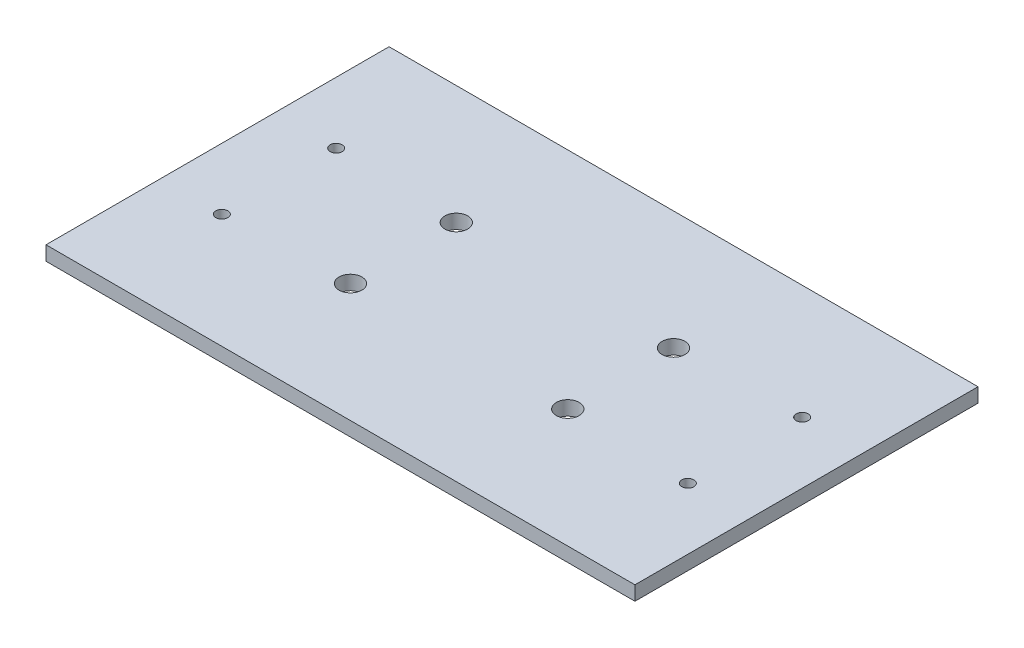
ISO-10303-21;
HEADER;
FILE_DESCRIPTION(('STEP AP214'),'2;1');
FILE_NAME('part.step','',(''),(''),'','','');
FILE_SCHEMA(('AUTOMOTIVE_DESIGN { 1 0 10303 214 1 1 1 1 }'));
ENDSEC;
DATA;
#1=APPLICATION_CONTEXT('core data for automotive mechanical design processes');
#2=APPLICATION_PROTOCOL_DEFINITION('international standard','automotive_design',2000,#1);
#3=PRODUCT_CONTEXT('',#1,'mechanical');
#4=PRODUCT('Part','Part','',(#3));
#5=PRODUCT_RELATED_PRODUCT_CATEGORY('part','',(#4));
#6=PRODUCT_DEFINITION_FORMATION('','',#4);
#7=PRODUCT_DEFINITION_CONTEXT('part definition',#1,'design');
#8=PRODUCT_DEFINITION('design','',#6,#7);
#9=PRODUCT_DEFINITION_SHAPE('','',#8);
#10=(LENGTH_UNIT() NAMED_UNIT(*) SI_UNIT(.MILLI.,.METRE.));
#11=(NAMED_UNIT(*) PLANE_ANGLE_UNIT() SI_UNIT($,.RADIAN.));
#12=(NAMED_UNIT(*) SI_UNIT($,.STERADIAN.) SOLID_ANGLE_UNIT());
#13=UNCERTAINTY_MEASURE_WITH_UNIT(LENGTH_MEASURE(1.E-05),#10,'distance_accuracy_value','');
#14=(GEOMETRIC_REPRESENTATION_CONTEXT(3) GLOBAL_UNCERTAINTY_ASSIGNED_CONTEXT((#13)) GLOBAL_UNIT_ASSIGNED_CONTEXT((#10,
#11,#12)) REPRESENTATION_CONTEXT('',''));
#15=CARTESIAN_POINT('',(0.,0.,0.));
#16=DIRECTION('',(0.,0.,1.));
#17=DIRECTION('',(1.,0.,0.));
#18=AXIS2_PLACEMENT_3D('',#15,#16,#17);
#19=CARTESIAN_POINT('',(103.,5.,60.));
#20=DIRECTION('',(-1.,0.,0.));
#21=DIRECTION('',(0.,0.,1.));
#22=AXIS2_PLACEMENT_3D('',#19,#20,#21);
#23=PLANE('',#22);
#24=DIRECTION('',(0.,0.,-1.));
#25=VECTOR('',#24,1.);
#26=CARTESIAN_POINT('',(103.,0.,60.));
#27=LINE('',#26,#25);
#28=CARTESIAN_POINT('',(103.,0.,60.));
#29=VERTEX_POINT('',#28);
#30=CARTESIAN_POINT('',(103.,0.,-60.));
#31=VERTEX_POINT('',#30);
#32=EDGE_CURVE('E100',#29,#31,#27,.T.);
#33=ORIENTED_EDGE('',*,*,#32,.T.);
#34=DIRECTION('',(0.,-1.,0.));
#35=VECTOR('',#34,1.);
#36=CARTESIAN_POINT('',(103.,5.,-60.));
#37=LINE('',#36,#35);
#38=CARTESIAN_POINT('',(103.,5.,-60.));
#39=VERTEX_POINT('',#38);
#40=EDGE_CURVE('E11',#39,#31,#37,.T.);
#41=ORIENTED_EDGE('',*,*,#40,.F.);
#42=DIRECTION('',(0.,0.,-1.));
#43=VECTOR('',#42,1.);
#44=CARTESIAN_POINT('',(103.,5.,60.));
#45=LINE('',#44,#43);
#46=CARTESIAN_POINT('',(103.,5.,60.));
#47=VERTEX_POINT('',#46);
#48=EDGE_CURVE('E88',#47,#39,#45,.T.);
#49=ORIENTED_EDGE('',*,*,#48,.F.);
#50=DIRECTION('',(0.,-1.,0.));
#51=VECTOR('',#50,1.);
#52=CARTESIAN_POINT('',(103.,5.,60.));
#53=LINE('',#52,#51);
#54=EDGE_CURVE('E96',#47,#29,#53,.T.);
#55=ORIENTED_EDGE('',*,*,#54,.T.);
#56=EDGE_LOOP('',(#33,#41,#49,#55));
#57=FACE_BOUND('',#56,.T.);
#58=ADVANCED_FACE('F37',(#57),#23,.F.);
#59=CARTESIAN_POINT('',(-103.,5.,-60.));
#60=DIRECTION('',(0.,0.,1.));
#61=DIRECTION('',(1.,0.,0.));
#62=AXIS2_PLACEMENT_3D('',#59,#60,#61);
#63=PLANE('',#62);
#64=DIRECTION('',(-1.,0.,0.));
#65=VECTOR('',#64,1.);
#66=CARTESIAN_POINT('',(-103.,0.,-60.));
#67=LINE('',#66,#65);
#68=CARTESIAN_POINT('',(-103.,0.,-60.));
#69=VERTEX_POINT('',#68);
#70=EDGE_CURVE('E92',#31,#69,#67,.T.);
#71=ORIENTED_EDGE('',*,*,#70,.T.);
#72=DIRECTION('',(0.,-1.,0.));
#73=VECTOR('',#72,1.);
#74=CARTESIAN_POINT('',(-103.,5.,-60.));
#75=LINE('',#74,#73);
#76=CARTESIAN_POINT('',(-103.,5.,-60.));
#77=VERTEX_POINT('',#76);
#78=EDGE_CURVE('E45',#77,#69,#75,.T.);
#79=ORIENTED_EDGE('',*,*,#78,.F.);
#80=DIRECTION('',(-1.,0.,0.));
#81=VECTOR('',#80,1.);
#82=CARTESIAN_POINT('',(-103.,5.,-60.));
#83=LINE('',#82,#81);
#84=EDGE_CURVE('E83',#39,#77,#83,.T.);
#85=ORIENTED_EDGE('',*,*,#84,.F.);
#86=ORIENTED_EDGE('',*,*,#40,.T.);
#87=EDGE_LOOP('',(#71,#79,#85,#86));
#88=FACE_BOUND('',#87,.T.);
#89=ADVANCED_FACE('F91',(#88),#63,.F.);
#90=CARTESIAN_POINT('',(-103.,5.,60.));
#91=DIRECTION('',(1.,0.,0.));
#92=DIRECTION('',(0.,0.,-1.));
#93=AXIS2_PLACEMENT_3D('',#90,#91,#92);
#94=PLANE('',#93);
#95=DIRECTION('',(0.,0.,1.));
#96=VECTOR('',#95,1.);
#97=CARTESIAN_POINT('',(-103.,0.,60.));
#98=LINE('',#97,#96);
#99=CARTESIAN_POINT('',(-103.,0.,60.));
#100=VERTEX_POINT('',#99);
#101=EDGE_CURVE('E70',#69,#100,#98,.T.);
#102=ORIENTED_EDGE('',*,*,#101,.T.);
#103=DIRECTION('',(0.,-1.,0.));
#104=VECTOR('',#103,1.);
#105=CARTESIAN_POINT('',(-103.,5.,60.));
#106=LINE('',#105,#104);
#107=CARTESIAN_POINT('',(-103.,5.,60.));
#108=VERTEX_POINT('',#107);
#109=EDGE_CURVE('E93',#108,#100,#106,.T.);
#110=ORIENTED_EDGE('',*,*,#109,.F.);
#111=DIRECTION('',(0.,0.,1.));
#112=VECTOR('',#111,1.);
#113=CARTESIAN_POINT('',(-103.,5.,60.));
#114=LINE('',#113,#112);
#115=EDGE_CURVE('E86',#77,#108,#114,.T.);
#116=ORIENTED_EDGE('',*,*,#115,.F.);
#117=ORIENTED_EDGE('',*,*,#78,.T.);
#118=EDGE_LOOP('',(#102,#110,#116,#117));
#119=FACE_BOUND('',#118,.T.);
#120=ADVANCED_FACE('F94',(#119),#94,.F.);
#121=CARTESIAN_POINT('',(-103.,5.,60.));
#122=DIRECTION('',(0.,0.,-1.));
#123=DIRECTION('',(-1.,0.,0.));
#124=AXIS2_PLACEMENT_3D('',#121,#122,#123);
#125=PLANE('',#124);
#126=DIRECTION('',(1.,0.,0.));
#127=VECTOR('',#126,1.);
#128=CARTESIAN_POINT('',(-103.,0.,60.));
#129=LINE('',#128,#127);
#130=EDGE_CURVE('E76',#100,#29,#129,.T.);
#131=ORIENTED_EDGE('',*,*,#130,.T.);
#132=ORIENTED_EDGE('',*,*,#54,.F.);
#133=DIRECTION('',(1.,0.,0.));
#134=VECTOR('',#133,1.);
#135=CARTESIAN_POINT('',(-103.,5.,60.));
#136=LINE('',#135,#134);
#137=EDGE_CURVE('E53',#108,#47,#136,.T.);
#138=ORIENTED_EDGE('',*,*,#137,.F.);
#139=ORIENTED_EDGE('',*,*,#109,.T.);
#140=EDGE_LOOP('',(#131,#132,#138,#139));
#141=FACE_BOUND('',#140,.T.);
#142=ADVANCED_FACE('F108',(#141),#125,.F.);
#143=CARTESIAN_POINT('',(0.,5.,0.));
#144=DIRECTION('',(0.,-1.,0.));
#145=DIRECTION('',(0.,0.,-1.));
#146=AXIS2_PLACEMENT_3D('',#143,#144,#145);
#147=PLANE('',#146);
#148=CARTESIAN_POINT('',(-38.,5.,18.5));
#149=DIRECTION('',(0.,1.,0.));
#150=DIRECTION('',(0.,0.,-1.));
#151=AXIS2_PLACEMENT_3D('',#148,#149,#150);
#152=CIRCLE('',#151,4.00000000000001);
#153=CARTESIAN_POINT('',(-38.,5.,14.5));
#154=VERTEX_POINT('',#153);
#155=EDGE_CURVE('E156',#154,#154,#152,.T.);
#156=ORIENTED_EDGE('',*,*,#155,.F.);
#157=EDGE_LOOP('',(#156));
#158=FACE_BOUND('',#157,.T.);
#159=CARTESIAN_POINT('',(38.,5.,18.5));
#160=DIRECTION('',(0.,1.,0.));
#161=DIRECTION('',(0.,0.,1.));
#162=AXIS2_PLACEMENT_3D('',#159,#160,#161);
#163=CIRCLE('',#162,4.00000000000001);
#164=CARTESIAN_POINT('',(38.,5.,22.5));
#165=VERTEX_POINT('',#164);
#166=EDGE_CURVE('E150',#165,#165,#163,.T.);
#167=ORIENTED_EDGE('',*,*,#166,.F.);
#168=EDGE_LOOP('',(#167));
#169=FACE_BOUND('',#168,.T.);
#170=CARTESIAN_POINT('',(38.,5.,-18.5));
#171=DIRECTION('',(0.,1.,0.));
#172=DIRECTION('',(0.,0.,-1.));
#173=AXIS2_PLACEMENT_3D('',#170,#171,#172);
#174=CIRCLE('',#173,4.00000000000001);
#175=CARTESIAN_POINT('',(38.,5.,-22.5));
#176=VERTEX_POINT('',#175);
#177=EDGE_CURVE('E144',#176,#176,#174,.T.);
#178=ORIENTED_EDGE('',*,*,#177,.F.);
#179=EDGE_LOOP('',(#178));
#180=FACE_BOUND('',#179,.T.);
#181=CARTESIAN_POINT('',(-38.,5.,-18.5));
#182=DIRECTION('',(0.,1.,0.));
#183=DIRECTION('',(0.,0.,1.));
#184=AXIS2_PLACEMENT_3D('',#181,#182,#183);
#185=CIRCLE('',#184,4.00000000000001);
#186=CARTESIAN_POINT('',(-38.,5.,-14.5));
#187=VERTEX_POINT('',#186);
#188=EDGE_CURVE('E138',#187,#187,#185,.T.);
#189=ORIENTED_EDGE('',*,*,#188,.F.);
#190=EDGE_LOOP('',(#189));
#191=FACE_BOUND('',#190,.T.);
#192=CARTESIAN_POINT('',(-81.5,5.,20.));
#193=DIRECTION('',(0.,1.,0.));
#194=DIRECTION('',(0.,0.,-1.));
#195=AXIS2_PLACEMENT_3D('',#192,#193,#194);
#196=CIRCLE('',#195,2.1);
#197=CARTESIAN_POINT('',(-81.5,5.,17.9));
#198=VERTEX_POINT('',#197);
#199=EDGE_CURVE('E132',#198,#198,#196,.T.);
#200=ORIENTED_EDGE('',*,*,#199,.F.);
#201=EDGE_LOOP('',(#200));
#202=FACE_BOUND('',#201,.T.);
#203=CARTESIAN_POINT('',(81.5,5.,20.));
#204=DIRECTION('',(0.,1.,0.));
#205=DIRECTION('',(0.,0.,1.));
#206=AXIS2_PLACEMENT_3D('',#203,#204,#205);
#207=CIRCLE('',#206,2.1);
#208=CARTESIAN_POINT('',(81.5,5.,22.1));
#209=VERTEX_POINT('',#208);
#210=EDGE_CURVE('E126',#209,#209,#207,.T.);
#211=ORIENTED_EDGE('',*,*,#210,.F.);
#212=EDGE_LOOP('',(#211));
#213=FACE_BOUND('',#212,.T.);
#214=CARTESIAN_POINT('',(81.5,5.,-20.));
#215=DIRECTION('',(0.,1.,0.));
#216=DIRECTION('',(0.,0.,-1.));
#217=AXIS2_PLACEMENT_3D('',#214,#215,#216);
#218=CIRCLE('',#217,2.1);
#219=CARTESIAN_POINT('',(81.5,5.,-22.1));
#220=VERTEX_POINT('',#219);
#221=EDGE_CURVE('E120',#220,#220,#218,.T.);
#222=ORIENTED_EDGE('',*,*,#221,.F.);
#223=EDGE_LOOP('',(#222));
#224=FACE_BOUND('',#223,.T.);
#225=CARTESIAN_POINT('',(-81.5,5.,-20.));
#226=DIRECTION('',(0.,1.,0.));
#227=DIRECTION('',(0.,0.,1.));
#228=AXIS2_PLACEMENT_3D('',#225,#226,#227);
#229=CIRCLE('',#228,2.1);
#230=CARTESIAN_POINT('',(-81.5,5.,-17.9));
#231=VERTEX_POINT('',#230);
#232=EDGE_CURVE('E114',#231,#231,#229,.T.);
#233=ORIENTED_EDGE('',*,*,#232,.F.);
#234=EDGE_LOOP('',(#233));
#235=FACE_BOUND('',#234,.T.);
#236=ORIENTED_EDGE('',*,*,#48,.T.);
#237=ORIENTED_EDGE('',*,*,#84,.T.);
#238=ORIENTED_EDGE('',*,*,#115,.T.);
#239=ORIENTED_EDGE('',*,*,#137,.T.);
#240=EDGE_LOOP('',(#236,#237,#238,#239));
#241=FACE_BOUND('',#240,.T.);
#242=ADVANCED_FACE('F84',(#158,#169,#180,#191,#202,#213,#224,#235,#241),#147,.F.);
#243=CARTESIAN_POINT('',(0.,0.,0.));
#244=DIRECTION('',(0.,-1.,0.));
#245=DIRECTION('',(0.,0.,-1.));
#246=AXIS2_PLACEMENT_3D('',#243,#244,#245);
#247=PLANE('',#246);
#248=CARTESIAN_POINT('',(-38.,0.,18.5));
#249=DIRECTION('',(0.,1.,0.));
#250=DIRECTION('',(0.,0.,-1.));
#251=AXIS2_PLACEMENT_3D('',#248,#249,#250);
#252=CIRCLE('',#251,4.00000000000001);
#253=CARTESIAN_POINT('',(-38.,0.,14.5));
#254=VERTEX_POINT('',#253);
#255=EDGE_CURVE('E153',#254,#254,#252,.T.);
#256=ORIENTED_EDGE('',*,*,#255,.T.);
#257=EDGE_LOOP('',(#256));
#258=FACE_BOUND('',#257,.T.);
#259=CARTESIAN_POINT('',(38.,0.,18.5));
#260=DIRECTION('',(0.,1.,0.));
#261=DIRECTION('',(0.,0.,1.));
#262=AXIS2_PLACEMENT_3D('',#259,#260,#261);
#263=CIRCLE('',#262,4.00000000000001);
#264=CARTESIAN_POINT('',(38.,0.,22.5));
#265=VERTEX_POINT('',#264);
#266=EDGE_CURVE('E147',#265,#265,#263,.T.);
#267=ORIENTED_EDGE('',*,*,#266,.T.);
#268=EDGE_LOOP('',(#267));
#269=FACE_BOUND('',#268,.T.);
#270=CARTESIAN_POINT('',(38.,0.,-18.5));
#271=DIRECTION('',(0.,1.,0.));
#272=DIRECTION('',(0.,0.,-1.));
#273=AXIS2_PLACEMENT_3D('',#270,#271,#272);
#274=CIRCLE('',#273,4.00000000000001);
#275=CARTESIAN_POINT('',(38.,0.,-22.5));
#276=VERTEX_POINT('',#275);
#277=EDGE_CURVE('E141',#276,#276,#274,.T.);
#278=ORIENTED_EDGE('',*,*,#277,.T.);
#279=EDGE_LOOP('',(#278));
#280=FACE_BOUND('',#279,.T.);
#281=CARTESIAN_POINT('',(-38.,0.,-18.5));
#282=DIRECTION('',(0.,1.,0.));
#283=DIRECTION('',(0.,0.,1.));
#284=AXIS2_PLACEMENT_3D('',#281,#282,#283);
#285=CIRCLE('',#284,4.00000000000001);
#286=CARTESIAN_POINT('',(-38.,0.,-14.5));
#287=VERTEX_POINT('',#286);
#288=EDGE_CURVE('E135',#287,#287,#285,.T.);
#289=ORIENTED_EDGE('',*,*,#288,.T.);
#290=EDGE_LOOP('',(#289));
#291=FACE_BOUND('',#290,.T.);
#292=CARTESIAN_POINT('',(-81.5,0.,20.));
#293=DIRECTION('',(0.,1.,0.));
#294=DIRECTION('',(0.,0.,-1.));
#295=AXIS2_PLACEMENT_3D('',#292,#293,#294);
#296=CIRCLE('',#295,2.1);
#297=CARTESIAN_POINT('',(-81.5,0.,17.9));
#298=VERTEX_POINT('',#297);
#299=EDGE_CURVE('E129',#298,#298,#296,.T.);
#300=ORIENTED_EDGE('',*,*,#299,.T.);
#301=EDGE_LOOP('',(#300));
#302=FACE_BOUND('',#301,.T.);
#303=CARTESIAN_POINT('',(81.5,0.,20.));
#304=DIRECTION('',(0.,1.,0.));
#305=DIRECTION('',(0.,0.,1.));
#306=AXIS2_PLACEMENT_3D('',#303,#304,#305);
#307=CIRCLE('',#306,2.1);
#308=CARTESIAN_POINT('',(81.5,0.,22.1));
#309=VERTEX_POINT('',#308);
#310=EDGE_CURVE('E123',#309,#309,#307,.T.);
#311=ORIENTED_EDGE('',*,*,#310,.T.);
#312=EDGE_LOOP('',(#311));
#313=FACE_BOUND('',#312,.T.);
#314=CARTESIAN_POINT('',(81.5,0.,-20.));
#315=DIRECTION('',(0.,1.,0.));
#316=DIRECTION('',(0.,0.,-1.));
#317=AXIS2_PLACEMENT_3D('',#314,#315,#316);
#318=CIRCLE('',#317,2.1);
#319=CARTESIAN_POINT('',(81.5,0.,-22.1));
#320=VERTEX_POINT('',#319);
#321=EDGE_CURVE('E117',#320,#320,#318,.T.);
#322=ORIENTED_EDGE('',*,*,#321,.T.);
#323=EDGE_LOOP('',(#322));
#324=FACE_BOUND('',#323,.T.);
#325=CARTESIAN_POINT('',(-81.5,0.,-20.));
#326=DIRECTION('',(0.,1.,0.));
#327=DIRECTION('',(0.,0.,1.));
#328=AXIS2_PLACEMENT_3D('',#325,#326,#327);
#329=CIRCLE('',#328,2.1);
#330=CARTESIAN_POINT('',(-81.5,0.,-17.9));
#331=VERTEX_POINT('',#330);
#332=EDGE_CURVE('E103',#331,#331,#329,.T.);
#333=ORIENTED_EDGE('',*,*,#332,.T.);
#334=EDGE_LOOP('',(#333));
#335=FACE_BOUND('',#334,.T.);
#336=ORIENTED_EDGE('',*,*,#32,.F.);
#337=ORIENTED_EDGE('',*,*,#130,.F.);
#338=ORIENTED_EDGE('',*,*,#101,.F.);
#339=ORIENTED_EDGE('',*,*,#70,.F.);
#340=EDGE_LOOP('',(#336,#337,#338,#339));
#341=FACE_BOUND('',#340,.T.);
#342=ADVANCED_FACE('F111',(#258,#269,#280,#291,#302,#313,#324,#335,#341),#247,.T.);
#343=CARTESIAN_POINT('',(-81.5,0.,-20.));
#344=DIRECTION('',(0.,1.,0.));
#345=DIRECTION('',(0.,0.,1.));
#346=AXIS2_PLACEMENT_3D('',#343,#344,#345);
#347=CYLINDRICAL_SURFACE('',#346,2.1);
#348=ORIENTED_EDGE('',*,*,#332,.F.);
#349=EDGE_LOOP('',(#348));
#350=FACE_BOUND('',#349,.T.);
#351=ORIENTED_EDGE('',*,*,#232,.T.);
#352=EDGE_LOOP('',(#351));
#353=FACE_BOUND('',#352,.T.);
#354=ADVANCED_FACE('F188',(#350,#353),#347,.F.);
#355=CARTESIAN_POINT('',(81.5,0.,-20.));
#356=DIRECTION('',(0.,1.,0.));
#357=DIRECTION('',(0.,0.,1.));
#358=AXIS2_PLACEMENT_3D('',#355,#356,#357);
#359=CYLINDRICAL_SURFACE('',#358,2.1);
#360=ORIENTED_EDGE('',*,*,#321,.F.);
#361=EDGE_LOOP('',(#360));
#362=FACE_BOUND('',#361,.T.);
#363=ORIENTED_EDGE('',*,*,#221,.T.);
#364=EDGE_LOOP('',(#363));
#365=FACE_BOUND('',#364,.T.);
#366=ADVANCED_FACE('F190',(#362,#365),#359,.F.);
#367=CARTESIAN_POINT('',(81.5,0.,20.));
#368=DIRECTION('',(0.,1.,0.));
#369=DIRECTION('',(0.,0.,1.));
#370=AXIS2_PLACEMENT_3D('',#367,#368,#369);
#371=CYLINDRICAL_SURFACE('',#370,2.1);
#372=ORIENTED_EDGE('',*,*,#310,.F.);
#373=EDGE_LOOP('',(#372));
#374=FACE_BOUND('',#373,.T.);
#375=ORIENTED_EDGE('',*,*,#210,.T.);
#376=EDGE_LOOP('',(#375));
#377=FACE_BOUND('',#376,.T.);
#378=ADVANCED_FACE('F197',(#374,#377),#371,.F.);
#379=CARTESIAN_POINT('',(-81.5,0.,20.));
#380=DIRECTION('',(0.,1.,0.));
#381=DIRECTION('',(0.,0.,1.));
#382=AXIS2_PLACEMENT_3D('',#379,#380,#381);
#383=CYLINDRICAL_SURFACE('',#382,2.1);
#384=ORIENTED_EDGE('',*,*,#299,.F.);
#385=EDGE_LOOP('',(#384));
#386=FACE_BOUND('',#385,.T.);
#387=ORIENTED_EDGE('',*,*,#199,.T.);
#388=EDGE_LOOP('',(#387));
#389=FACE_BOUND('',#388,.T.);
#390=ADVANCED_FACE('F239',(#386,#389),#383,.F.);
#391=CARTESIAN_POINT('',(-38.,0.,-18.5));
#392=DIRECTION('',(0.,1.,0.));
#393=DIRECTION('',(0.,0.,1.));
#394=AXIS2_PLACEMENT_3D('',#391,#392,#393);
#395=CYLINDRICAL_SURFACE('',#394,4.00000000000001);
#396=ORIENTED_EDGE('',*,*,#288,.F.);
#397=EDGE_LOOP('',(#396));
#398=FACE_BOUND('',#397,.T.);
#399=ORIENTED_EDGE('',*,*,#188,.T.);
#400=EDGE_LOOP('',(#399));
#401=FACE_BOUND('',#400,.T.);
#402=ADVANCED_FACE('F233',(#398,#401),#395,.F.);
#403=CARTESIAN_POINT('',(38.,0.,-18.5));
#404=DIRECTION('',(0.,1.,0.));
#405=DIRECTION('',(0.,0.,1.));
#406=AXIS2_PLACEMENT_3D('',#403,#404,#405);
#407=CYLINDRICAL_SURFACE('',#406,4.00000000000001);
#408=ORIENTED_EDGE('',*,*,#277,.F.);
#409=EDGE_LOOP('',(#408));
#410=FACE_BOUND('',#409,.T.);
#411=ORIENTED_EDGE('',*,*,#177,.T.);
#412=EDGE_LOOP('',(#411));
#413=FACE_BOUND('',#412,.T.);
#414=ADVANCED_FACE('F238',(#410,#413),#407,.F.);
#415=CARTESIAN_POINT('',(38.,0.,18.5));
#416=DIRECTION('',(0.,1.,0.));
#417=DIRECTION('',(0.,0.,1.));
#418=AXIS2_PLACEMENT_3D('',#415,#416,#417);
#419=CYLINDRICAL_SURFACE('',#418,4.00000000000001);
#420=ORIENTED_EDGE('',*,*,#266,.F.);
#421=EDGE_LOOP('',(#420));
#422=FACE_BOUND('',#421,.T.);
#423=ORIENTED_EDGE('',*,*,#166,.T.);
#424=EDGE_LOOP('',(#423));
#425=FACE_BOUND('',#424,.T.);
#426=ADVANCED_FACE('F167',(#422,#425),#419,.F.);
#427=CARTESIAN_POINT('',(-38.,0.,18.5));
#428=DIRECTION('',(0.,1.,0.));
#429=DIRECTION('',(0.,0.,1.));
#430=AXIS2_PLACEMENT_3D('',#427,#428,#429);
#431=CYLINDRICAL_SURFACE('',#430,4.00000000000001);
#432=ORIENTED_EDGE('',*,*,#255,.F.);
#433=EDGE_LOOP('',(#432));
#434=FACE_BOUND('',#433,.T.);
#435=ORIENTED_EDGE('',*,*,#155,.T.);
#436=EDGE_LOOP('',(#435));
#437=FACE_BOUND('',#436,.T.);
#438=ADVANCED_FACE('F164',(#434,#437),#431,.F.);
#439=CLOSED_SHELL('',(#58,#89,#120,#142,#242,#342,#354,#366,#378,#390,#402,#414,#426,#438));
#440=MANIFOLD_SOLID_BREP('B2',#439);
#441=ADVANCED_BREP_SHAPE_REPRESENTATION('',(#18,#440),#14);
#442=SHAPE_DEFINITION_REPRESENTATION(#9,#441);
ENDSEC;
END-ISO-10303-21;
